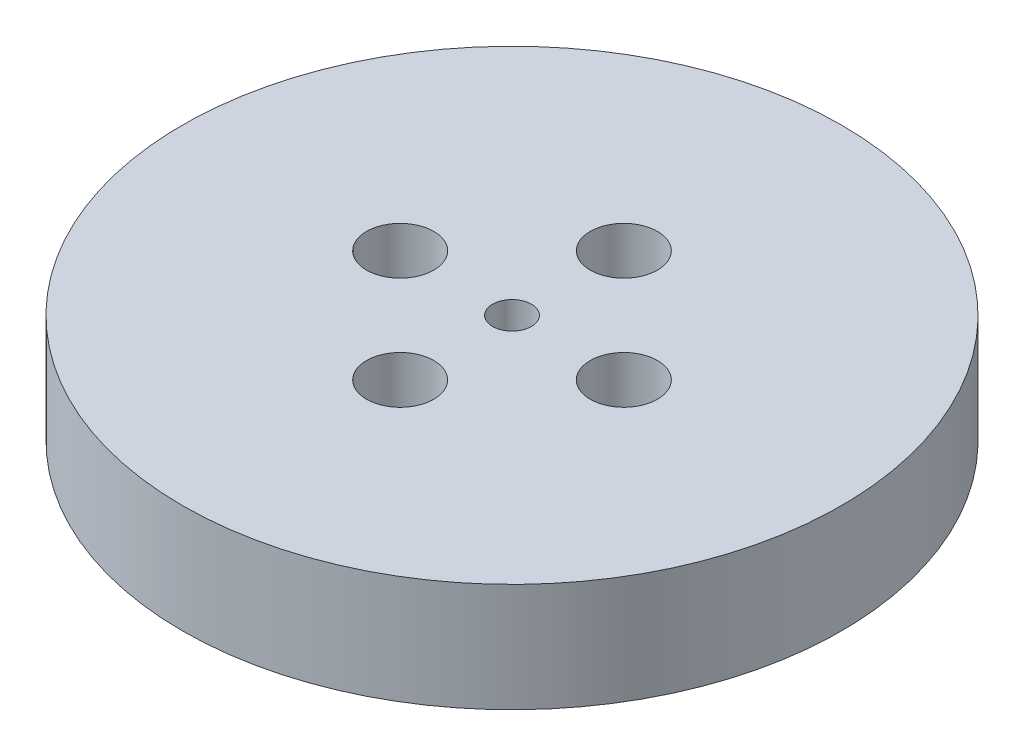
ISO-10303-21;
HEADER;
FILE_DESCRIPTION(('STEP AP214'),'2;1');
FILE_NAME('part.step','',(''),(''),'','','');
FILE_SCHEMA(('AUTOMOTIVE_DESIGN { 1 0 10303 214 1 1 1 1 }'));
ENDSEC;
DATA;
#1=APPLICATION_CONTEXT('core data for automotive mechanical design processes');
#2=APPLICATION_PROTOCOL_DEFINITION('international standard','automotive_design',2000,#1);
#3=PRODUCT_CONTEXT('',#1,'mechanical');
#4=PRODUCT('Part','Part','',(#3));
#5=PRODUCT_RELATED_PRODUCT_CATEGORY('part','',(#4));
#6=PRODUCT_DEFINITION_FORMATION('','',#4);
#7=PRODUCT_DEFINITION_CONTEXT('part definition',#1,'design');
#8=PRODUCT_DEFINITION('design','',#6,#7);
#9=PRODUCT_DEFINITION_SHAPE('','',#8);
#10=(LENGTH_UNIT() NAMED_UNIT(*) SI_UNIT(.MILLI.,.METRE.));
#11=(NAMED_UNIT(*) PLANE_ANGLE_UNIT() SI_UNIT($,.RADIAN.));
#12=(NAMED_UNIT(*) SI_UNIT($,.STERADIAN.) SOLID_ANGLE_UNIT());
#13=UNCERTAINTY_MEASURE_WITH_UNIT(LENGTH_MEASURE(1.E-05),#10,'distance_accuracy_value','');
#14=(GEOMETRIC_REPRESENTATION_CONTEXT(3) GLOBAL_UNCERTAINTY_ASSIGNED_CONTEXT((#13)) GLOBAL_UNIT_ASSIGNED_CONTEXT((#10,
#11,#12)) REPRESENTATION_CONTEXT('',''));
#15=CARTESIAN_POINT('',(0.,0.,0.));
#16=DIRECTION('',(0.,0.,1.));
#17=DIRECTION('',(1.,0.,0.));
#18=AXIS2_PLACEMENT_3D('',#15,#16,#17);
#19=CARTESIAN_POINT('',(0.,28.,0.));
#20=DIRECTION('',(0.,-1.,0.));
#21=DIRECTION('',(0.,0.,-1.));
#22=AXIS2_PLACEMENT_3D('',#19,#20,#21);
#23=CYLINDRICAL_SURFACE('',#22,85.);
#24=CARTESIAN_POINT('',(0.,28.,0.));
#25=DIRECTION('',(0.,1.,0.));
#26=DIRECTION('',(0.,0.,1.));
#27=AXIS2_PLACEMENT_3D('',#24,#25,#26);
#28=CIRCLE('',#27,85.);
#29=CARTESIAN_POINT('',(0.,28.,85.));
#30=VERTEX_POINT('',#29);
#31=EDGE_CURVE('E10',#30,#30,#28,.T.);
#32=ORIENTED_EDGE('',*,*,#31,.F.);
#33=EDGE_LOOP('',(#32));
#34=FACE_BOUND('',#33,.T.);
#35=CARTESIAN_POINT('',(0.,0.,0.));
#36=DIRECTION('',(0.,1.,0.));
#37=DIRECTION('',(0.,0.,1.));
#38=AXIS2_PLACEMENT_3D('',#35,#36,#37);
#39=CIRCLE('',#38,85.);
#40=CARTESIAN_POINT('',(0.,0.,85.));
#41=VERTEX_POINT('',#40);
#42=EDGE_CURVE('E37',#41,#41,#39,.T.);
#43=ORIENTED_EDGE('',*,*,#42,.T.);
#44=EDGE_LOOP('',(#43));
#45=FACE_BOUND('',#44,.T.);
#46=ADVANCED_FACE('F40',(#34,#45),#23,.T.);
#47=CARTESIAN_POINT('',(0.,28.,0.));
#48=DIRECTION('',(0.,1.,0.));
#49=DIRECTION('',(0.,0.,1.));
#50=AXIS2_PLACEMENT_3D('',#47,#48,#49);
#51=PLANE('',#50);
#52=CARTESIAN_POINT('',(1.00706950827118E-13,28.,28.843617093622));
#53=DIRECTION('',(0.,1.,0.));
#54=DIRECTION('',(1.,0.,0.));
#55=AXIS2_PLACEMENT_3D('',#52,#53,#54);
#56=CIRCLE('',#55,8.6668515314078);
#57=CARTESIAN_POINT('',(8.6668515314079,28.,28.843617093622));
#58=VERTEX_POINT('',#57);
#59=EDGE_CURVE('E71',#58,#58,#56,.T.);
#60=ORIENTED_EDGE('',*,*,#59,.F.);
#61=EDGE_LOOP('',(#60));
#62=FACE_BOUND('',#61,.T.);
#63=CARTESIAN_POINT('',(28.843617093622,28.,0.));
#64=DIRECTION('',(0.,1.,0.));
#65=DIRECTION('',(0.,0.,-1.));
#66=AXIS2_PLACEMENT_3D('',#63,#64,#65);
#67=CIRCLE('',#66,8.6668515314078);
#68=CARTESIAN_POINT('',(28.843617093622,28.,-8.6668515314078));
#69=VERTEX_POINT('',#68);
#70=EDGE_CURVE('E70',#69,#69,#67,.T.);
#71=ORIENTED_EDGE('',*,*,#70,.F.);
#72=EDGE_LOOP('',(#71));
#73=FACE_BOUND('',#72,.T.);
#74=CARTESIAN_POINT('',(-3.02120852481354E-13,28.,-28.843617093622));
#75=DIRECTION('',(0.,1.,0.));
#76=DIRECTION('',(-1.,0.,0.));
#77=AXIS2_PLACEMENT_3D('',#74,#75,#76);
#78=CIRCLE('',#77,8.6668515314078);
#79=CARTESIAN_POINT('',(-8.6668515314081,28.,-28.8436170936219));
#80=VERTEX_POINT('',#79);
#81=EDGE_CURVE('E61',#80,#80,#78,.T.);
#82=ORIENTED_EDGE('',*,*,#81,.F.);
#83=EDGE_LOOP('',(#82));
#84=FACE_BOUND('',#83,.T.);
#85=CARTESIAN_POINT('',(-28.843617093622,28.,0.));
#86=DIRECTION('',(0.,1.,0.));
#87=DIRECTION('',(0.,0.,1.));
#88=AXIS2_PLACEMENT_3D('',#85,#86,#87);
#89=CIRCLE('',#88,8.6668515314078);
#90=CARTESIAN_POINT('',(-28.843617093622,28.,8.6668515314078));
#91=VERTEX_POINT('',#90);
#92=EDGE_CURVE('E54',#91,#91,#89,.T.);
#93=ORIENTED_EDGE('',*,*,#92,.F.);
#94=EDGE_LOOP('',(#93));
#95=FACE_BOUND('',#94,.T.);
#96=CARTESIAN_POINT('',(0.,28.,0.));
#97=DIRECTION('',(0.,1.,0.));
#98=DIRECTION('',(0.,0.,1.));
#99=AXIS2_PLACEMENT_3D('',#96,#97,#98);
#100=CIRCLE('',#99,5.);
#101=CARTESIAN_POINT('',(0.,28.,5.));
#102=VERTEX_POINT('',#101);
#103=EDGE_CURVE('E50',#102,#102,#100,.T.);
#104=ORIENTED_EDGE('',*,*,#103,.F.);
#105=EDGE_LOOP('',(#104));
#106=FACE_BOUND('',#105,.T.);
#107=ORIENTED_EDGE('',*,*,#31,.T.);
#108=EDGE_LOOP('',(#107));
#109=FACE_BOUND('',#108,.T.);
#110=ADVANCED_FACE('F86',(#62,#73,#84,#95,#106,#109),#51,.T.);
#111=CARTESIAN_POINT('',(0.,0.,0.));
#112=DIRECTION('',(0.,1.,0.));
#113=DIRECTION('',(0.,0.,1.));
#114=AXIS2_PLACEMENT_3D('',#111,#112,#113);
#115=PLANE('',#114);
#116=CARTESIAN_POINT('',(0.,0.,0.));
#117=DIRECTION('',(0.,1.,0.));
#118=DIRECTION('',(0.,0.,1.));
#119=AXIS2_PLACEMENT_3D('',#116,#117,#118);
#120=CIRCLE('',#119,5.);
#121=CARTESIAN_POINT('',(0.,0.,5.));
#122=VERTEX_POINT('',#121);
#123=EDGE_CURVE('E47',#122,#122,#120,.T.);
#124=ORIENTED_EDGE('',*,*,#123,.T.);
#125=EDGE_LOOP('',(#124));
#126=FACE_BOUND('',#125,.T.);
#127=ORIENTED_EDGE('',*,*,#42,.F.);
#128=EDGE_LOOP('',(#127));
#129=FACE_BOUND('',#128,.T.);
#130=ADVANCED_FACE('F93',(#126,#129),#115,.F.);
#131=CARTESIAN_POINT('',(0.,28.,0.));
#132=DIRECTION('',(0.,-1.,0.));
#133=DIRECTION('',(0.,0.,-1.));
#134=AXIS2_PLACEMENT_3D('',#131,#132,#133);
#135=CYLINDRICAL_SURFACE('',#134,5.);
#136=ORIENTED_EDGE('',*,*,#103,.T.);
#137=EDGE_LOOP('',(#136));
#138=FACE_BOUND('',#137,.T.);
#139=ORIENTED_EDGE('',*,*,#123,.F.);
#140=EDGE_LOOP('',(#139));
#141=FACE_BOUND('',#140,.T.);
#142=ADVANCED_FACE('F101',(#138,#141),#135,.F.);
#143=CARTESIAN_POINT('',(-28.843617093622,9.33052705942491,0.));
#144=DIRECTION('',(0.,1.,0.));
#145=DIRECTION('',(0.,0.,1.));
#146=AXIS2_PLACEMENT_3D('',#143,#144,#145);
#147=CYLINDRICAL_SURFACE('',#146,8.6668515314078);
#148=CARTESIAN_POINT('',(-28.843617093622,9.33052705942491,0.));
#149=DIRECTION('',(0.,1.,0.));
#150=DIRECTION('',(0.,0.,1.));
#151=AXIS2_PLACEMENT_3D('',#148,#149,#150);
#152=CIRCLE('',#151,8.6668515314078);
#153=CARTESIAN_POINT('',(-28.843617093622,9.33052705942491,8.6668515314078));
#154=VERTEX_POINT('',#153);
#155=EDGE_CURVE('E55',#154,#154,#152,.T.);
#156=ORIENTED_EDGE('',*,*,#155,.F.);
#157=EDGE_LOOP('',(#156));
#158=FACE_BOUND('',#157,.T.);
#159=ORIENTED_EDGE('',*,*,#92,.T.);
#160=EDGE_LOOP('',(#159));
#161=FACE_BOUND('',#160,.T.);
#162=ADVANCED_FACE('F102',(#158,#161),#147,.F.);
#163=CARTESIAN_POINT('',(-28.843617093622,9.33052705942491,0.));
#164=DIRECTION('',(0.,1.,0.));
#165=DIRECTION('',(0.,0.,1.));
#166=AXIS2_PLACEMENT_3D('',#163,#164,#165);
#167=PLANE('',#166);
#168=ORIENTED_EDGE('',*,*,#155,.T.);
#169=EDGE_LOOP('',(#168));
#170=FACE_BOUND('',#169,.T.);
#171=ADVANCED_FACE('F133',(#170),#167,.T.);
#172=CARTESIAN_POINT('',(-3.02120852481354E-13,9.33052705942491,-28.843617093622));
#173=DIRECTION('',(0.,1.,0.));
#174=DIRECTION('',(0.,0.,1.));
#175=AXIS2_PLACEMENT_3D('',#172,#173,#174);
#176=CYLINDRICAL_SURFACE('',#175,8.6668515314078);
#177=CARTESIAN_POINT('',(-3.02120852481354E-13,9.33052705942491,-28.843617093622));
#178=DIRECTION('',(0.,1.,0.));
#179=DIRECTION('',(-1.,0.,0.));
#180=AXIS2_PLACEMENT_3D('',#177,#178,#179);
#181=CIRCLE('',#180,8.6668515314078);
#182=CARTESIAN_POINT('',(-8.6668515314081,9.33052705942491,-28.8436170936219));
#183=VERTEX_POINT('',#182);
#184=EDGE_CURVE('E63',#183,#183,#181,.T.);
#185=ORIENTED_EDGE('',*,*,#184,.F.);
#186=EDGE_LOOP('',(#185));
#187=FACE_BOUND('',#186,.T.);
#188=ORIENTED_EDGE('',*,*,#81,.T.);
#189=EDGE_LOOP('',(#188));
#190=FACE_BOUND('',#189,.T.);
#191=ADVANCED_FACE('F142',(#187,#190),#176,.F.);
#192=CARTESIAN_POINT('',(-3.02120852481354E-13,9.33052705942491,-28.843617093622));
#193=DIRECTION('',(0.,1.,0.));
#194=DIRECTION('',(-1.,0.,0.));
#195=AXIS2_PLACEMENT_3D('',#192,#193,#194);
#196=PLANE('',#195);
#197=ORIENTED_EDGE('',*,*,#184,.T.);
#198=EDGE_LOOP('',(#197));
#199=FACE_BOUND('',#198,.T.);
#200=ADVANCED_FACE('F156',(#199),#196,.T.);
#201=CARTESIAN_POINT('',(28.843617093622,9.33052705942491,0.));
#202=DIRECTION('',(0.,1.,0.));
#203=DIRECTION('',(0.,0.,1.));
#204=AXIS2_PLACEMENT_3D('',#201,#202,#203);
#205=CYLINDRICAL_SURFACE('',#204,8.6668515314078);
#206=CARTESIAN_POINT('',(28.843617093622,9.33052705942491,0.));
#207=DIRECTION('',(0.,1.,0.));
#208=DIRECTION('',(0.,0.,-1.));
#209=AXIS2_PLACEMENT_3D('',#206,#207,#208);
#210=CIRCLE('',#209,8.6668515314078);
#211=CARTESIAN_POINT('',(28.843617093622,9.33052705942491,-8.6668515314078));
#212=VERTEX_POINT('',#211);
#213=EDGE_CURVE('E69',#212,#212,#210,.T.);
#214=ORIENTED_EDGE('',*,*,#213,.F.);
#215=EDGE_LOOP('',(#214));
#216=FACE_BOUND('',#215,.T.);
#217=ORIENTED_EDGE('',*,*,#70,.T.);
#218=EDGE_LOOP('',(#217));
#219=FACE_BOUND('',#218,.T.);
#220=ADVANCED_FACE('F164',(#216,#219),#205,.F.);
#221=CARTESIAN_POINT('',(28.843617093622,9.33052705942491,0.));
#222=DIRECTION('',(0.,1.,0.));
#223=DIRECTION('',(0.,0.,-1.));
#224=AXIS2_PLACEMENT_3D('',#221,#222,#223);
#225=PLANE('',#224);
#226=ORIENTED_EDGE('',*,*,#213,.T.);
#227=EDGE_LOOP('',(#226));
#228=FACE_BOUND('',#227,.T.);
#229=ADVANCED_FACE('F83',(#228),#225,.T.);
#230=CARTESIAN_POINT('',(1.00706950827118E-13,9.33052705942491,28.843617093622));
#231=DIRECTION('',(0.,1.,0.));
#232=DIRECTION('',(0.,0.,1.));
#233=AXIS2_PLACEMENT_3D('',#230,#231,#232);
#234=CYLINDRICAL_SURFACE('',#233,8.6668515314078);
#235=CARTESIAN_POINT('',(1.00706950827118E-13,9.33052705942491,28.843617093622));
#236=DIRECTION('',(0.,1.,0.));
#237=DIRECTION('',(1.,0.,0.));
#238=AXIS2_PLACEMENT_3D('',#235,#236,#237);
#239=CIRCLE('',#238,8.6668515314078);
#240=CARTESIAN_POINT('',(8.6668515314079,9.33052705942491,28.843617093622));
#241=VERTEX_POINT('',#240);
#242=EDGE_CURVE('E59',#241,#241,#239,.T.);
#243=ORIENTED_EDGE('',*,*,#242,.F.);
#244=EDGE_LOOP('',(#243));
#245=FACE_BOUND('',#244,.T.);
#246=ORIENTED_EDGE('',*,*,#59,.T.);
#247=EDGE_LOOP('',(#246));
#248=FACE_BOUND('',#247,.T.);
#249=ADVANCED_FACE('F81',(#245,#248),#234,.F.);
#250=CARTESIAN_POINT('',(1.00706950827118E-13,9.33052705942491,28.843617093622));
#251=DIRECTION('',(0.,1.,0.));
#252=DIRECTION('',(1.,0.,0.));
#253=AXIS2_PLACEMENT_3D('',#250,#251,#252);
#254=PLANE('',#253);
#255=ORIENTED_EDGE('',*,*,#242,.T.);
#256=EDGE_LOOP('',(#255));
#257=FACE_BOUND('',#256,.T.);
#258=ADVANCED_FACE('F78',(#257),#254,.T.);
#259=CLOSED_SHELL('',(#46,#110,#130,#142,#162,#171,#191,#200,#220,#229,#249,#258));
#260=MANIFOLD_SOLID_BREP('B2',#259);
#261=ADVANCED_BREP_SHAPE_REPRESENTATION('',(#18,#260),#14);
#262=SHAPE_DEFINITION_REPRESENTATION(#9,#261);
ENDSEC;
END-ISO-10303-21;
